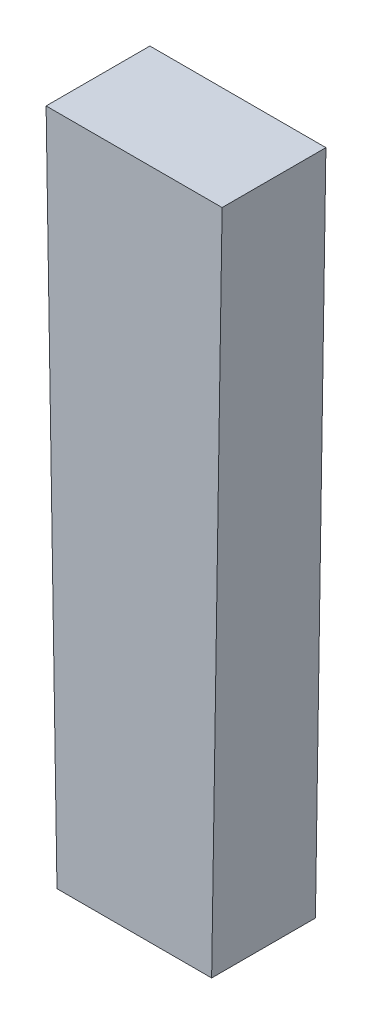
ISO-10303-21;
HEADER;
FILE_DESCRIPTION(('STEP AP214'),'2;1');
FILE_NAME('part.step','',(''),(''),'','','');
FILE_SCHEMA(('AUTOMOTIVE_DESIGN { 1 0 10303 214 1 1 1 1 }'));
ENDSEC;
DATA;
#1=APPLICATION_CONTEXT('core data for automotive mechanical design processes');
#2=APPLICATION_PROTOCOL_DEFINITION('international standard','automotive_design',2000,#1);
#3=PRODUCT_CONTEXT('',#1,'mechanical');
#4=PRODUCT('Part','Part','',(#3));
#5=PRODUCT_RELATED_PRODUCT_CATEGORY('part','',(#4));
#6=PRODUCT_DEFINITION_FORMATION('','',#4);
#7=PRODUCT_DEFINITION_CONTEXT('part definition',#1,'design');
#8=PRODUCT_DEFINITION('design','',#6,#7);
#9=PRODUCT_DEFINITION_SHAPE('','',#8);
#10=(LENGTH_UNIT() NAMED_UNIT(*) SI_UNIT(.MILLI.,.METRE.));
#11=(NAMED_UNIT(*) PLANE_ANGLE_UNIT() SI_UNIT($,.RADIAN.));
#12=(NAMED_UNIT(*) SI_UNIT($,.STERADIAN.) SOLID_ANGLE_UNIT());
#13=UNCERTAINTY_MEASURE_WITH_UNIT(LENGTH_MEASURE(1.E-05),#10,'distance_accuracy_value','');
#14=(GEOMETRIC_REPRESENTATION_CONTEXT(3) GLOBAL_UNCERTAINTY_ASSIGNED_CONTEXT((#13)) GLOBAL_UNIT_ASSIGNED_CONTEXT((#10,
#11,#12)) REPRESENTATION_CONTEXT('',''));
#15=CARTESIAN_POINT('',(0.,0.,0.));
#16=DIRECTION('',(0.,0.,1.));
#17=DIRECTION('',(1.,0.,0.));
#18=AXIS2_PLACEMENT_3D('',#15,#16,#17);
#19=CARTESIAN_POINT('',(170.322641469723,130.717625928766,-38.9997200126349));
#20=DIRECTION('',(0.,0.,-1.));
#21=DIRECTION('',(-1.,0.,0.));
#22=AXIS2_PLACEMENT_3D('',#19,#20,#21);
#23=PLANE('',#22);
#24=DIRECTION('',(0.0155700952002486,0.999878778720428,0.));
#25=VECTOR('',#24,1.);
#26=CARTESIAN_POINT('',(170.397152618215,130.717625928766,-38.9997200126349));
#27=LINE('',#26,#25);
#28=CARTESIAN_POINT('',(170.407242669573,131.365587813361,-38.9997200126349));
#29=VERTEX_POINT('',#28);
#30=CARTESIAN_POINT('',(170.397152618215,130.717625928766,-38.9997200126349));
#31=VERTEX_POINT('',#30);
#32=EDGE_CURVE('E79',#29,#31,#27,.F.);
#33=ORIENTED_EDGE('',*,*,#32,.F.);
#34=DIRECTION('',(1.,0.,0.));
#35=VECTOR('',#34,1.);
#36=CARTESIAN_POINT('',(170.407242669573,131.365587813361,-38.9997200126349));
#37=LINE('',#36,#35);
#38=CARTESIAN_POINT('',(170.237652190975,131.365587813361,-38.9997200126349));
#39=VERTEX_POINT('',#38);
#40=EDGE_CURVE('E55',#39,#29,#37,.T.);
#41=ORIENTED_EDGE('',*,*,#40,.F.);
#42=DIRECTION('',(0.0161687913569439,-0.999869276548717,0.));
#43=VECTOR('',#42,1.);
#44=CARTESIAN_POINT('',(170.237652190975,131.365587813361,-38.9997200126349));
#45=LINE('',#44,#43);
#46=CARTESIAN_POINT('',(170.248130321232,130.717625928766,-38.9997200126349));
#47=VERTEX_POINT('',#46);
#48=EDGE_CURVE('E57',#47,#39,#45,.F.);
#49=ORIENTED_EDGE('',*,*,#48,.F.);
#50=DIRECTION('',(1.,0.,0.));
#51=VECTOR('',#50,1.);
#52=CARTESIAN_POINT('',(170.248130321232,130.717625928766,-38.9997200126349));
#53=LINE('',#52,#51);
#54=EDGE_CURVE('E20',#31,#47,#53,.F.);
#55=ORIENTED_EDGE('',*,*,#54,.F.);
#56=EDGE_LOOP('',(#33,#41,#49,#55));
#57=FACE_BOUND('',#56,.T.);
#58=ADVANCED_FACE('F17',(#57),#23,.F.);
#59=CARTESIAN_POINT('',(170.248130321232,130.717625928766,-39.0997200126349));
#60=DIRECTION('',(0.,-1.,0.));
#61=DIRECTION('',(0.,0.,-1.));
#62=AXIS2_PLACEMENT_3D('',#59,#60,#61);
#63=PLANE('',#62);
#64=DIRECTION('',(-1.,0.,0.));
#65=VECTOR('',#64,1.);
#66=CARTESIAN_POINT('',(170.322641469723,130.717625928766,-39.0997200126349));
#67=LINE('',#66,#65);
#68=CARTESIAN_POINT('',(170.397152618215,130.717625928766,-39.0997200126349));
#69=VERTEX_POINT('',#68);
#70=CARTESIAN_POINT('',(170.248130321232,130.717625928766,-39.0997200126349));
#71=VERTEX_POINT('',#70);
#72=EDGE_CURVE('E83',#69,#71,#67,.T.);
#73=ORIENTED_EDGE('',*,*,#72,.F.);
#74=DIRECTION('',(0.,0.,1.));
#75=VECTOR('',#74,1.);
#76=CARTESIAN_POINT('',(170.397152618215,130.717625928766,-39.0997200126349));
#77=LINE('',#76,#75);
#78=EDGE_CURVE('E68',#31,#69,#77,.F.);
#79=ORIENTED_EDGE('',*,*,#78,.F.);
#80=ORIENTED_EDGE('',*,*,#54,.T.);
#81=DIRECTION('',(0.,0.,1.));
#82=VECTOR('',#81,1.);
#83=CARTESIAN_POINT('',(170.248130321232,130.717625928766,-39.0997200126349));
#84=LINE('',#83,#82);
#85=EDGE_CURVE('E63',#71,#47,#84,.T.);
#86=ORIENTED_EDGE('',*,*,#85,.F.);
#87=EDGE_LOOP('',(#73,#79,#80,#86));
#88=FACE_BOUND('',#87,.T.);
#89=ADVANCED_FACE('F65',(#88),#63,.T.);
#90=CARTESIAN_POINT('',(170.237652190975,131.365587813361,-39.0997200126349));
#91=DIRECTION('',(-0.999869276548717,-0.0161687913569439,0.));
#92=DIRECTION('',(0.0161687913569439,-0.999869276548717,0.));
#93=AXIS2_PLACEMENT_3D('',#90,#91,#92);
#94=PLANE('',#93);
#95=DIRECTION('',(-0.0161687913568994,0.999869276548718,0.));
#96=VECTOR('',#95,1.);
#97=CARTESIAN_POINT('',(170.248130321232,130.717625928766,-39.0997200126349));
#98=LINE('',#97,#96);
#99=CARTESIAN_POINT('',(170.237652190975,131.365587813361,-39.0997200126349));
#100=VERTEX_POINT('',#99);
#101=EDGE_CURVE('E72',#71,#100,#98,.T.);
#102=ORIENTED_EDGE('',*,*,#101,.F.);
#103=ORIENTED_EDGE('',*,*,#85,.T.);
#104=ORIENTED_EDGE('',*,*,#48,.T.);
#105=DIRECTION('',(0.,0.,1.));
#106=VECTOR('',#105,1.);
#107=CARTESIAN_POINT('',(170.237652190975,131.365587813361,-39.0997200126349));
#108=LINE('',#107,#106);
#109=EDGE_CURVE('E75',#100,#39,#108,.T.);
#110=ORIENTED_EDGE('',*,*,#109,.F.);
#111=EDGE_LOOP('',(#102,#103,#104,#110));
#112=FACE_BOUND('',#111,.T.);
#113=ADVANCED_FACE('F70',(#112),#94,.T.);
#114=CARTESIAN_POINT('',(170.407242669573,131.365587813361,-39.0997200126349));
#115=DIRECTION('',(0.,1.,0.));
#116=DIRECTION('',(0.,0.,1.));
#117=AXIS2_PLACEMENT_3D('',#114,#115,#116);
#118=PLANE('',#117);
#119=DIRECTION('',(-1.,0.,0.));
#120=VECTOR('',#119,1.);
#121=CARTESIAN_POINT('',(170.322641469723,131.365587813361,-39.0997200126349));
#122=LINE('',#121,#120);
#123=CARTESIAN_POINT('',(170.407242669573,131.365587813361,-39.0997200126349));
#124=VERTEX_POINT('',#123);
#125=EDGE_CURVE('E26',#100,#124,#122,.F.);
#126=ORIENTED_EDGE('',*,*,#125,.F.);
#127=ORIENTED_EDGE('',*,*,#109,.T.);
#128=ORIENTED_EDGE('',*,*,#40,.T.);
#129=DIRECTION('',(0.,0.,1.));
#130=VECTOR('',#129,1.);
#131=CARTESIAN_POINT('',(170.407242669573,131.365587813361,-39.0997200126349));
#132=LINE('',#131,#130);
#133=EDGE_CURVE('E35',#124,#29,#132,.T.);
#134=ORIENTED_EDGE('',*,*,#133,.F.);
#135=EDGE_LOOP('',(#126,#127,#128,#134));
#136=FACE_BOUND('',#135,.T.);
#137=ADVANCED_FACE('F89',(#136),#118,.T.);
#138=CARTESIAN_POINT('',(170.397152618215,130.717625928766,-39.0997200126349));
#139=DIRECTION('',(0.999878778720428,-0.0155700952002486,0.));
#140=DIRECTION('',(0.0155700952002486,0.999878778720428,0.));
#141=AXIS2_PLACEMENT_3D('',#138,#139,#140);
#142=PLANE('',#141);
#143=DIRECTION('',(-0.0155700952002469,-0.999878778720428,0.));
#144=VECTOR('',#143,1.);
#145=CARTESIAN_POINT('',(170.407242669573,131.365587813361,-39.0997200126349));
#146=LINE('',#145,#144);
#147=EDGE_CURVE('E11',#124,#69,#146,.T.);
#148=ORIENTED_EDGE('',*,*,#147,.F.);
#149=ORIENTED_EDGE('',*,*,#133,.T.);
#150=ORIENTED_EDGE('',*,*,#32,.T.);
#151=ORIENTED_EDGE('',*,*,#78,.T.);
#152=EDGE_LOOP('',(#148,#149,#150,#151));
#153=FACE_BOUND('',#152,.T.);
#154=ADVANCED_FACE('F91',(#153),#142,.T.);
#155=CARTESIAN_POINT('',(170.322641469723,130.717625928766,-39.0997200126349));
#156=DIRECTION('',(0.,0.,-1.));
#157=DIRECTION('',(-1.,0.,0.));
#158=AXIS2_PLACEMENT_3D('',#155,#156,#157);
#159=PLANE('',#158);
#160=ORIENTED_EDGE('',*,*,#125,.T.);
#161=ORIENTED_EDGE('',*,*,#147,.T.);
#162=ORIENTED_EDGE('',*,*,#72,.T.);
#163=ORIENTED_EDGE('',*,*,#101,.T.);
#164=EDGE_LOOP('',(#160,#161,#162,#163));
#165=FACE_BOUND('',#164,.T.);
#166=ADVANCED_FACE('F88',(#165),#159,.T.);
#167=CLOSED_SHELL('',(#58,#89,#113,#137,#154,#166));
#168=MANIFOLD_SOLID_BREP('B1',#167);
#169=ADVANCED_BREP_SHAPE_REPRESENTATION('',(#18,#168),#14);
#170=SHAPE_DEFINITION_REPRESENTATION(#9,#169);
ENDSEC;
END-ISO-10303-21;
